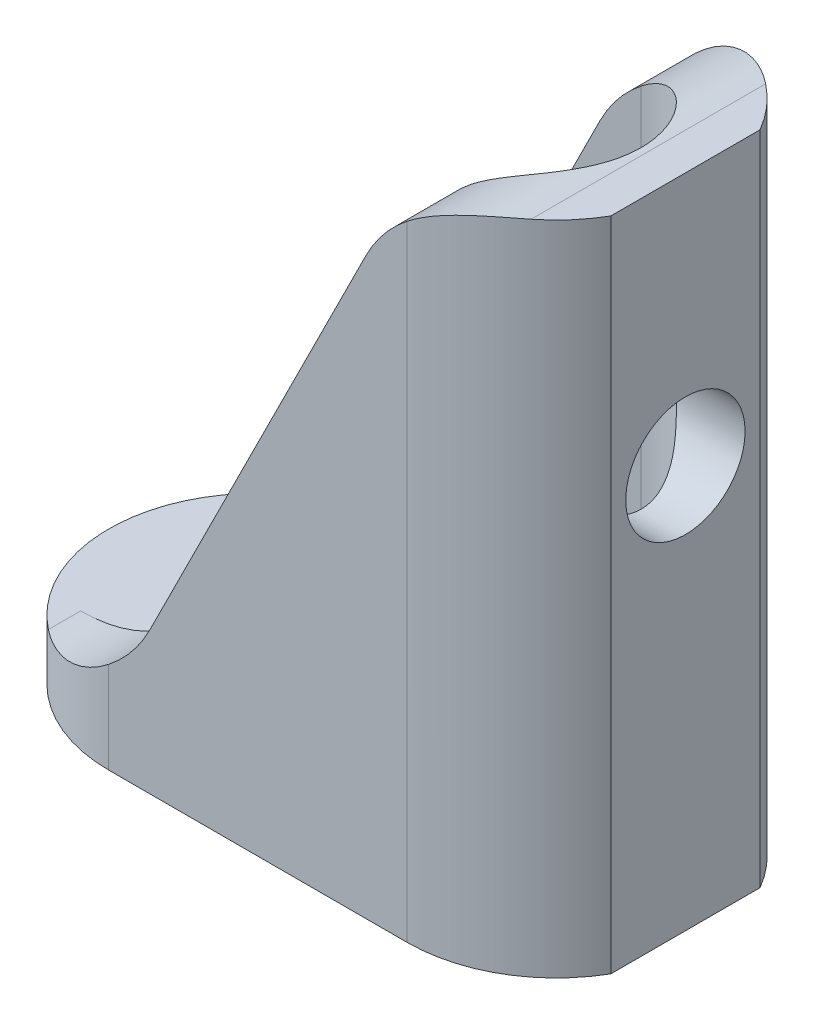
ISO-10303-21;
HEADER;
FILE_DESCRIPTION(('STEP AP214'),'2;1');
FILE_NAME('part.step','',(''),(''),'','','');
FILE_SCHEMA(('AUTOMOTIVE_DESIGN { 1 0 10303 214 1 1 1 1 }'));
ENDSEC;
DATA;
#1=APPLICATION_CONTEXT('core data for automotive mechanical design processes');
#2=APPLICATION_PROTOCOL_DEFINITION('international standard','automotive_design',2000,#1);
#3=PRODUCT_CONTEXT('',#1,'mechanical');
#4=PRODUCT('Part','Part','',(#3));
#5=PRODUCT_RELATED_PRODUCT_CATEGORY('part','',(#4));
#6=PRODUCT_DEFINITION_FORMATION('','',#4);
#7=PRODUCT_DEFINITION_CONTEXT('part definition',#1,'design');
#8=PRODUCT_DEFINITION('design','',#6,#7);
#9=PRODUCT_DEFINITION_SHAPE('','',#8);
#10=(LENGTH_UNIT() NAMED_UNIT(*) SI_UNIT(.MILLI.,.METRE.));
#11=(NAMED_UNIT(*) PLANE_ANGLE_UNIT() SI_UNIT($,.RADIAN.));
#12=(NAMED_UNIT(*) SI_UNIT($,.STERADIAN.) SOLID_ANGLE_UNIT());
#13=UNCERTAINTY_MEASURE_WITH_UNIT(LENGTH_MEASURE(1.E-05),#10,'distance_accuracy_value','');
#14=(GEOMETRIC_REPRESENTATION_CONTEXT(3) GLOBAL_UNCERTAINTY_ASSIGNED_CONTEXT((#13)) GLOBAL_UNIT_ASSIGNED_CONTEXT((#10,
#11,#12)) REPRESENTATION_CONTEXT('',''));
#15=CARTESIAN_POINT('',(0.,0.,0.));
#16=DIRECTION('',(0.,0.,1.));
#17=DIRECTION('',(1.,0.,0.));
#18=AXIS2_PLACEMENT_3D('',#15,#16,#17);
#19=CARTESIAN_POINT('',(0.,0.,0.));
#20=DIRECTION('',(0.,1.,0.));
#21=DIRECTION('',(0.,0.,1.));
#22=AXIS2_PLACEMENT_3D('',#19,#20,#21);
#23=PLANE('',#22);
#24=CARTESIAN_POINT('',(0.,0.,0.));
#25=DIRECTION('',(0.,1.,0.));
#26=DIRECTION('',(0.,0.,1.));
#27=AXIS2_PLACEMENT_3D('',#24,#25,#26);
#28=CIRCLE('',#27,2.);
#29=CARTESIAN_POINT('',(0.,0.,-2.));
#30=VERTEX_POINT('',#29);
#31=CARTESIAN_POINT('',(0.,0.,2.));
#32=VERTEX_POINT('',#31);
#33=EDGE_CURVE('E205',#30,#32,#28,.T.);
#34=ORIENTED_EDGE('',*,*,#33,.T.);
#35=DIRECTION('',(1.,0.,0.));
#36=VECTOR('',#35,1.);
#37=CARTESIAN_POINT('',(0.,0.,2.));
#38=LINE('',#37,#36);
#39=CARTESIAN_POINT('',(10.,0.,2.));
#40=VERTEX_POINT('',#39);
#41=EDGE_CURVE('E219',#32,#40,#38,.T.);
#42=ORIENTED_EDGE('',*,*,#41,.T.);
#43=CARTESIAN_POINT('',(10.,0.,0.));
#44=DIRECTION('',(0.,1.,0.));
#45=DIRECTION('',(0.,0.,1.));
#46=AXIS2_PLACEMENT_3D('',#43,#44,#45);
#47=CIRCLE('',#46,2.);
#48=CARTESIAN_POINT('',(10.,0.,-2.));
#49=VERTEX_POINT('',#48);
#50=EDGE_CURVE('E222',#40,#49,#47,.T.);
#51=ORIENTED_EDGE('',*,*,#50,.T.);
#52=DIRECTION('',(-1.,0.,0.));
#53=VECTOR('',#52,1.);
#54=CARTESIAN_POINT('',(0.,0.,-2.));
#55=LINE('',#54,#53);
#56=EDGE_CURVE('E209',#49,#30,#55,.T.);
#57=ORIENTED_EDGE('',*,*,#56,.T.);
#58=EDGE_LOOP('',(#34,#42,#51,#57));
#59=FACE_BOUND('',#58,.T.);
#60=DIRECTION('',(0.,0.,1.));
#61=VECTOR('',#60,1.);
#62=CARTESIAN_POINT('',(14.3301270189222,0.,0.));
#63=LINE('',#62,#61);
#64=CARTESIAN_POINT('',(14.3301270189222,0.,-2.5));
#65=VERTEX_POINT('',#64);
#66=CARTESIAN_POINT('',(14.3301270189222,0.,2.5));
#67=VERTEX_POINT('',#66);
#68=EDGE_CURVE('E171',#65,#67,#63,.T.);
#69=ORIENTED_EDGE('',*,*,#68,.T.);
#70=CARTESIAN_POINT('',(10.,0.,0.));
#71=DIRECTION('',(0.,1.,0.));
#72=DIRECTION('',(0.,0.,1.));
#73=AXIS2_PLACEMENT_3D('',#70,#71,#72);
#74=CIRCLE('',#73,5.);
#75=CARTESIAN_POINT('',(10.,0.,5.));
#76=VERTEX_POINT('',#75);
#77=EDGE_CURVE('E180',#76,#67,#74,.T.);
#78=ORIENTED_EDGE('',*,*,#77,.F.);
#79=DIRECTION('',(1.,0.,0.));
#80=VECTOR('',#79,1.);
#81=CARTESIAN_POINT('',(0.,0.,5.));
#82=LINE('',#81,#80);
#83=CARTESIAN_POINT('',(0.,0.,5.));
#84=VERTEX_POINT('',#83);
#85=EDGE_CURVE('E243',#84,#76,#82,.T.);
#86=ORIENTED_EDGE('',*,*,#85,.F.);
#87=CARTESIAN_POINT('',(0.,0.,0.));
#88=DIRECTION('',(0.,1.,0.));
#89=DIRECTION('',(0.,0.,1.));
#90=AXIS2_PLACEMENT_3D('',#87,#88,#89);
#91=CIRCLE('',#90,5.);
#92=CARTESIAN_POINT('',(0.,0.,-5.));
#93=VERTEX_POINT('',#92);
#94=EDGE_CURVE('E236',#93,#84,#91,.T.);
#95=ORIENTED_EDGE('',*,*,#94,.F.);
#96=DIRECTION('',(-1.,0.,0.));
#97=VECTOR('',#96,1.);
#98=CARTESIAN_POINT('',(0.,0.,-5.));
#99=LINE('',#98,#97);
#100=CARTESIAN_POINT('',(10.,0.,-5.));
#101=VERTEX_POINT('',#100);
#102=EDGE_CURVE('E241',#101,#93,#99,.T.);
#103=ORIENTED_EDGE('',*,*,#102,.F.);
#104=EDGE_CURVE('E246',#65,#101,#74,.T.);
#105=ORIENTED_EDGE('',*,*,#104,.F.);
#106=EDGE_LOOP('',(#69,#78,#86,#95,#103,#105));
#107=FACE_BOUND('',#106,.T.);
#108=ADVANCED_FACE('F34',(#59,#107),#23,.F.);
#109=CARTESIAN_POINT('',(10.,2.,0.));
#110=DIRECTION('',(0.,-1.,0.));
#111=DIRECTION('',(0.,0.,-1.));
#112=AXIS2_PLACEMENT_3D('',#109,#110,#111);
#113=CYLINDRICAL_SURFACE('',#112,5.);
#114=DIRECTION('',(0.,-1.,0.));
#115=VECTOR('',#114,1.);
#116=CARTESIAN_POINT('',(14.3301270189222,22.,2.5));
#117=LINE('',#116,#115);
#118=CARTESIAN_POINT('',(14.3301270189222,22.,2.5));
#119=VERTEX_POINT('',#118);
#120=EDGE_CURVE('E166',#119,#67,#117,.T.);
#121=ORIENTED_EDGE('',*,*,#120,.F.);
#122=CARTESIAN_POINT('',(10.,22.,0.));
#123=DIRECTION('',(0.,1.,0.));
#124=DIRECTION('',(0.,0.,1.));
#125=AXIS2_PLACEMENT_3D('',#122,#123,#124);
#126=CIRCLE('',#125,5.);
#127=CARTESIAN_POINT('',(13.0901699437495,22.,3.93075688878712));
#128=VERTEX_POINT('',#127);
#129=EDGE_CURVE('E177',#128,#119,#126,.T.);
#130=ORIENTED_EDGE('',*,*,#129,.F.);
#131=CARTESIAN_POINT('',(13.0901699437495,22.,3.93075688878712));
#132=CARTESIAN_POINT('',(13.0049567409293,22.0000106443207,3.99777049014228));
#133=CARTESIAN_POINT('',(12.9175208470636,21.9978217442673,4.06200131989047));
#134=CARTESIAN_POINT('',(12.7388048481984,21.9884392743008,4.18457248866539));
#135=CARTESIAN_POINT('',(12.6475226677203,21.9812429690137,4.24290958819303));
#136=CARTESIAN_POINT('',(12.4620063268731,21.9612599378402,4.35317751358719));
#137=CARTESIAN_POINT('',(12.3677788210296,21.9484850725356,4.40512163286476));
#138=CARTESIAN_POINT('',(12.1770081701362,21.9168566209036,4.50245442391839));
#139=CARTESIAN_POINT('',(12.0804655506896,21.8980044024555,4.54784456752568));
#140=CARTESIAN_POINT('',(11.8854971729066,21.8537407726496,4.63208679928392));
#141=CARTESIAN_POINT('',(11.7870649051567,21.828300287882,4.67090861356537));
#142=CARTESIAN_POINT('',(11.5897188625495,21.7706617958058,4.74170693083525));
#143=CARTESIAN_POINT('',(11.4908050907298,21.7384638310726,4.77368347694948));
#144=CARTESIAN_POINT('',(11.2935256677494,21.6672324217771,4.83087284963891));
#145=CARTESIAN_POINT('',(11.1951598274356,21.6282015091605,4.85608817285053));
#146=CARTESIAN_POINT('',(10.9999505607425,21.5433820963228,4.90001198960971));
#147=CARTESIAN_POINT('',(10.9031068367935,21.4975949355799,4.91872177046883));
#148=CARTESIAN_POINT('',(10.6660059218015,21.375915635311,4.95751275578921));
#149=CARTESIAN_POINT('',(10.5271283574913,21.2960960678455,4.97397326413417));
#150=CARTESIAN_POINT('',(10.3247243511915,21.1663848841562,4.9899055437224));
#151=CARTESIAN_POINT('',(10.2582391095803,21.1214821189729,4.99375653453521));
#152=CARTESIAN_POINT('',(10.1274419436835,21.0284828500238,4.99880320397726));
#153=CARTESIAN_POINT('',(10.0631298713663,20.9803865644579,4.99999906382872));
#154=CARTESIAN_POINT('',(10.,20.9307568887871,5.));
#155=B_SPLINE_CURVE_WITH_KNOTS('',3,(#131,#132,#133,#134,#135,#136,#137,#138,#139,#140,#141,
#142,#143,#144,#145,#146,#147,#148,#149,#150,#151,#152,#153,#154),.UNSPECIFIED.,.F.,.F.,(4,2,2,
2,2,2,2,2,2,2,2,4),(0.,0.325182185280488,0.650542146048252,0.975213701247999,1.29981223093417,
1.62586834497974,1.95192240478201,2.27785590015483,2.60372486331215,3.08538584626341,
3.32623627685176,3.56707026802709),.UNSPECIFIED.);
#156=CARTESIAN_POINT('',(10.,20.9307568887871,5.));
#157=VERTEX_POINT('',#156);
#158=EDGE_CURVE('E293',#128,#157,#155,.T.);
#159=ORIENTED_EDGE('',*,*,#158,.T.);
#160=DIRECTION('',(0.,-1.,0.));
#161=VECTOR('',#160,1.);
#162=CARTESIAN_POINT('',(10.,2.,5.));
#163=LINE('',#162,#161);
#164=EDGE_CURVE('E254',#157,#76,#163,.T.);
#165=ORIENTED_EDGE('',*,*,#164,.T.);
#166=ORIENTED_EDGE('',*,*,#77,.T.);
#167=EDGE_LOOP('',(#121,#130,#159,#165,#166));
#168=FACE_BOUND('',#167,.T.);
#169=ADVANCED_FACE('F176',(#168),#113,.T.);
#170=DIRECTION('',(0.,-1.,0.));
#171=VECTOR('',#170,1.);
#172=CARTESIAN_POINT('',(14.3301270189222,22.,-2.5));
#173=LINE('',#172,#171);
#174=CARTESIAN_POINT('',(14.3301270189222,22.,-2.5));
#175=VERTEX_POINT('',#174);
#176=EDGE_CURVE('E50',#175,#65,#173,.T.);
#177=ORIENTED_EDGE('',*,*,#176,.T.);
#178=ORIENTED_EDGE('',*,*,#104,.T.);
#179=DIRECTION('',(0.,-1.,0.));
#180=VECTOR('',#179,1.);
#181=CARTESIAN_POINT('',(10.,2.,-5.));
#182=LINE('',#181,#180);
#183=CARTESIAN_POINT('',(10.,20.9307568887871,-5.));
#184=VERTEX_POINT('',#183);
#185=EDGE_CURVE('E251',#184,#101,#182,.T.);
#186=ORIENTED_EDGE('',*,*,#185,.F.);
#187=CARTESIAN_POINT('',(10.,20.9307568887871,-5.));
#188=CARTESIAN_POINT('',(10.0852132028201,20.9977704901423,-5.00001064432072));
#189=CARTESIAN_POINT('',(10.1726490966859,21.0620013198905,-4.99782174426735));
#190=CARTESIAN_POINT('',(10.3513650955511,21.1845724886654,-4.98843927430082));
#191=CARTESIAN_POINT('',(10.4426472760292,21.242909588193,-4.98124296901368));
#192=CARTESIAN_POINT('',(10.6281636168764,21.3531775135872,-4.96125993784018));
#193=CARTESIAN_POINT('',(10.7223911227199,21.4051216328648,-4.9484850725356));
#194=CARTESIAN_POINT('',(10.9131617736132,21.5024544239184,-4.91685662090355));
#195=CARTESIAN_POINT('',(11.0097043930599,21.5478445675257,-4.89800440245554));
#196=CARTESIAN_POINT('',(11.2046727708429,21.6320867992839,-4.85374077264961));
#197=CARTESIAN_POINT('',(11.3031050385928,21.6709086135654,-4.82830028788198));
#198=CARTESIAN_POINT('',(11.5004510812,21.7417069308352,-4.77066179580583));
#199=CARTESIAN_POINT('',(11.5993648530197,21.7736834769495,-4.73846383107256));
#200=CARTESIAN_POINT('',(11.796644276,21.8308728496389,-4.6672324217771));
#201=CARTESIAN_POINT('',(11.8950101163139,21.8560881728505,-4.62820150916051));
#202=CARTESIAN_POINT('',(12.090219383007,21.9000119896097,-4.54338209632282));
#203=CARTESIAN_POINT('',(12.187063106956,21.9187217704688,-4.49759493557987));
#204=CARTESIAN_POINT('',(12.424164021948,21.9575127557892,-4.37591563531105));
#205=CARTESIAN_POINT('',(12.5630415862582,21.9739732641342,-4.29609606784546));
#206=CARTESIAN_POINT('',(12.765445592558,21.9899055437224,-4.16638488415618));
#207=CARTESIAN_POINT('',(12.8319308341691,21.9937565345352,-4.12148211897293));
#208=CARTESIAN_POINT('',(12.9627280000659,21.9988032039773,-4.02848285002378));
#209=CARTESIAN_POINT('',(13.0270400723831,21.9999990638287,-3.98038656445792));
#210=CARTESIAN_POINT('',(13.0901699437495,22.,-3.93075688878712));
#211=B_SPLINE_CURVE_WITH_KNOTS('',3,(#187,#188,#189,#190,#191,#192,#193,#194,#195,#196,#197,
#198,#199,#200,#201,#202,#203,#204,#205,#206,#207,#208,#209,#210),.UNSPECIFIED.,.F.,.F.,(4,2,2,
2,2,2,2,2,2,2,2,4),(0.,0.325182185280489,0.650542146048251,0.975213701247997,1.29981223093417,
1.62586834497974,1.95192240478201,2.27785590015482,2.60372486331214,3.0853858462634,
3.32623627685175,3.56707026802709),.UNSPECIFIED.);
#212=CARTESIAN_POINT('',(13.0901699437495,22.,-3.93075688878712));
#213=VERTEX_POINT('',#212);
#214=EDGE_CURVE('E301',#184,#213,#211,.T.);
#215=ORIENTED_EDGE('',*,*,#214,.T.);
#216=EDGE_CURVE('E187',#175,#213,#126,.T.);
#217=ORIENTED_EDGE('',*,*,#216,.F.);
#218=EDGE_LOOP('',(#177,#178,#186,#215,#217));
#219=FACE_BOUND('',#218,.T.);
#220=ADVANCED_FACE('F310',(#219),#113,.T.);
#221=CARTESIAN_POINT('',(0.,22.,0.));
#222=DIRECTION('',(0.,1.,0.));
#223=DIRECTION('',(0.,0.,1.));
#224=AXIS2_PLACEMENT_3D('',#221,#222,#223);
#225=PLANE('',#224);
#226=ORIENTED_EDGE('',*,*,#129,.T.);
#227=DIRECTION('',(0.,0.,1.));
#228=VECTOR('',#227,1.);
#229=CARTESIAN_POINT('',(14.3301270189222,22.,0.));
#230=LINE('',#229,#228);
#231=EDGE_CURVE('E163',#175,#119,#230,.T.);
#232=ORIENTED_EDGE('',*,*,#231,.F.);
#233=ORIENTED_EDGE('',*,*,#216,.T.);
#234=DIRECTION('',(0.,0.,-1.));
#235=VECTOR('',#234,1.);
#236=CARTESIAN_POINT('',(13.0901699437495,22.,-2.85));
#237=LINE('',#236,#235);
#238=EDGE_CURVE('E185',#213,#128,#237,.F.);
#239=ORIENTED_EDGE('',*,*,#238,.T.);
#240=EDGE_LOOP('',(#226,#232,#233,#239));
#241=FACE_BOUND('',#240,.T.);
#242=ADVANCED_FACE('F183',(#241),#225,.T.);
#243=CARTESIAN_POINT('',(0.,2.,0.));
#244=DIRECTION('',(0.,1.,0.));
#245=DIRECTION('',(0.,0.,1.));
#246=AXIS2_PLACEMENT_3D('',#243,#244,#245);
#247=PLANE('',#246);
#248=DIRECTION('',(1.,0.,0.));
#249=VECTOR('',#248,1.);
#250=CARTESIAN_POINT('',(0.,2.,2.));
#251=LINE('',#250,#249);
#252=CARTESIAN_POINT('',(0.,2.,2.));
#253=VERTEX_POINT('',#252);
#254=CARTESIAN_POINT('',(10.,2.,2.));
#255=VERTEX_POINT('',#254);
#256=EDGE_CURVE('E208',#253,#255,#251,.T.);
#257=ORIENTED_EDGE('',*,*,#256,.F.);
#258=CARTESIAN_POINT('',(0.,2.,0.));
#259=DIRECTION('',(0.,1.,0.));
#260=DIRECTION('',(0.,0.,1.));
#261=AXIS2_PLACEMENT_3D('',#258,#259,#260);
#262=CIRCLE('',#261,2.);
#263=CARTESIAN_POINT('',(0.,2.,-2.));
#264=VERTEX_POINT('',#263);
#265=EDGE_CURVE('E206',#264,#253,#262,.T.);
#266=ORIENTED_EDGE('',*,*,#265,.F.);
#267=DIRECTION('',(-1.,0.,0.));
#268=VECTOR('',#267,1.);
#269=CARTESIAN_POINT('',(0.,2.,-2.));
#270=LINE('',#269,#268);
#271=CARTESIAN_POINT('',(10.,2.,-2.));
#272=VERTEX_POINT('',#271);
#273=EDGE_CURVE('E214',#272,#264,#270,.T.);
#274=ORIENTED_EDGE('',*,*,#273,.F.);
#275=CARTESIAN_POINT('',(10.,2.,0.));
#276=DIRECTION('',(0.,1.,0.));
#277=DIRECTION('',(0.,0.,1.));
#278=AXIS2_PLACEMENT_3D('',#275,#276,#277);
#279=CIRCLE('',#278,2.);
#280=EDGE_CURVE('E211',#255,#272,#279,.T.);
#281=ORIENTED_EDGE('',*,*,#280,.F.);
#282=EDGE_LOOP('',(#257,#266,#274,#281));
#283=FACE_BOUND('',#282,.T.);
#284=DIRECTION('',(1.,0.,0.));
#285=VECTOR('',#284,1.);
#286=CARTESIAN_POINT('',(0.,2.,-2.85));
#287=LINE('',#286,#285);
#288=CARTESIAN_POINT('',(-3.09016994374947,2.,-2.85));
#289=VERTEX_POINT('',#288);
#290=CARTESIAN_POINT('',(10.,2.,-2.85));
#291=VERTEX_POINT('',#290);
#292=EDGE_CURVE('E191',#289,#291,#287,.T.);
#293=ORIENTED_EDGE('',*,*,#292,.F.);
#294=DIRECTION('',(0.,0.,-1.));
#295=VECTOR('',#294,1.);
#296=CARTESIAN_POINT('',(-3.09016994374947,2.,0.));
#297=LINE('',#296,#295);
#298=CARTESIAN_POINT('',(-3.09016994374947,2.,-3.93075688878712));
#299=VERTEX_POINT('',#298);
#300=EDGE_CURVE('E365',#289,#299,#297,.T.);
#301=ORIENTED_EDGE('',*,*,#300,.T.);
#302=CARTESIAN_POINT('',(0.,2.,0.));
#303=DIRECTION('',(0.,1.,0.));
#304=DIRECTION('',(0.,0.,1.));
#305=AXIS2_PLACEMENT_3D('',#302,#303,#304);
#306=CIRCLE('',#305,5.);
#307=CARTESIAN_POINT('',(-3.09016994374947,2.,3.93075688878712));
#308=VERTEX_POINT('',#307);
#309=EDGE_CURVE('E237',#299,#308,#306,.T.);
#310=ORIENTED_EDGE('',*,*,#309,.T.);
#311=DIRECTION('',(0.,0.,1.));
#312=VECTOR('',#311,1.);
#313=CARTESIAN_POINT('',(-3.09016994374947,2.,0.));
#314=LINE('',#313,#312);
#315=CARTESIAN_POINT('',(-3.09016994374947,2.,2.85));
#316=VERTEX_POINT('',#315);
#317=EDGE_CURVE('E385',#308,#316,#314,.F.);
#318=ORIENTED_EDGE('',*,*,#317,.T.);
#319=DIRECTION('',(1.,0.,0.));
#320=VECTOR('',#319,1.);
#321=CARTESIAN_POINT('',(0.,2.,2.85));
#322=LINE('',#321,#320);
#323=CARTESIAN_POINT('',(10.,2.,2.85));
#324=VERTEX_POINT('',#323);
#325=EDGE_CURVE('E199',#316,#324,#322,.T.);
#326=ORIENTED_EDGE('',*,*,#325,.T.);
#327=CARTESIAN_POINT('',(10.,2.,0.));
#328=DIRECTION('',(0.,1.,0.));
#329=DIRECTION('',(0.,0.,1.));
#330=AXIS2_PLACEMENT_3D('',#327,#328,#329);
#331=CIRCLE('',#330,2.85);
#332=EDGE_CURVE('E196',#324,#291,#331,.T.);
#333=ORIENTED_EDGE('',*,*,#332,.T.);
#334=EDGE_LOOP('',(#293,#301,#310,#318,#326,#333));
#335=FACE_BOUND('',#334,.T.);
#336=ADVANCED_FACE('F323',(#283,#335),#247,.T.);
#337=CARTESIAN_POINT('',(0.,2.,0.));
#338=DIRECTION('',(0.,-1.,0.));
#339=DIRECTION('',(0.,0.,-1.));
#340=AXIS2_PLACEMENT_3D('',#337,#338,#339);
#341=CYLINDRICAL_SURFACE('',#340,5.);
#342=ORIENTED_EDGE('',*,*,#94,.T.);
#343=DIRECTION('',(0.,-1.,0.));
#344=VECTOR('',#343,1.);
#345=CARTESIAN_POINT('',(0.,2.,5.));
#346=LINE('',#345,#344);
#347=CARTESIAN_POINT('',(0.,3.06924311121288,5.));
#348=VERTEX_POINT('',#347);
#349=EDGE_CURVE('E58',#348,#84,#346,.T.);
#350=ORIENTED_EDGE('',*,*,#349,.F.);
#351=CARTESIAN_POINT('',(0.,3.06924311121288,5.));
#352=CARTESIAN_POINT('',(-0.0852132028201255,3.00222950985772,5.00001064432072));
#353=CARTESIAN_POINT('',(-0.172649096685909,2.93799868010953,4.99782174426735));
#354=CARTESIAN_POINT('',(-0.351365095551066,2.81542751133461,4.98843927430082));
#355=CARTESIAN_POINT('',(-0.44264727602915,2.75709041180697,4.98124296901368));
#356=CARTESIAN_POINT('',(-0.628163616876409,2.64682248641282,4.96125993784018));
#357=CARTESIAN_POINT('',(-0.722391122719878,2.59487836713524,4.9484850725356));
#358=CARTESIAN_POINT('',(-0.913161773613238,2.49754557608161,4.91685662090355));
#359=CARTESIAN_POINT('',(-1.00970439305987,2.45215543247432,4.89800440245554));
#360=CARTESIAN_POINT('',(-1.20467277084289,2.36791320071608,4.85374077264961));
#361=CARTESIAN_POINT('',(-1.30310503859279,2.32909138643463,4.82830028788199));
#362=CARTESIAN_POINT('',(-1.50045108119997,2.25829306916475,4.77066179580583));
#363=CARTESIAN_POINT('',(-1.59936485301972,2.22631652305052,4.73846383107256));
#364=CARTESIAN_POINT('',(-1.79664427600004,2.16912715036109,4.6672324217771));
#365=CARTESIAN_POINT('',(-1.89501011631387,2.14391182714947,4.6282015091605));
#366=CARTESIAN_POINT('',(-2.090219383007,2.09998801039029,4.54338209632282));
#367=CARTESIAN_POINT('',(-2.187063106956,2.08127822953117,4.49759493557986));
#368=CARTESIAN_POINT('',(-2.42416402194802,2.04248724421079,4.37591563531105));
#369=CARTESIAN_POINT('',(-2.56304158625822,2.02602673586583,4.29609606784546));
#370=CARTESIAN_POINT('',(-2.76544559255797,2.0100944562776,4.16638488415618));
#371=CARTESIAN_POINT('',(-2.83193083416913,2.00624346546479,4.12148211897293));
#372=CARTESIAN_POINT('',(-2.96272800006594,2.00119679602274,4.02848285002378));
#373=CARTESIAN_POINT('',(-3.02704007238313,2.00000093617128,3.98038656445792));
#374=CARTESIAN_POINT('',(-3.09016994374947,2.,3.93075688878712));
#375=B_SPLINE_CURVE_WITH_KNOTS('',3,(#351,#352,#353,#354,#355,#356,#357,#358,#359,#360,#361,
#362,#363,#364,#365,#366,#367,#368,#369,#370,#371,#372,#373,#374),.UNSPECIFIED.,.F.,.F.,(4,2,2,
2,2,2,2,2,2,2,2,4),(0.,0.325182185280487,0.650542146048251,0.975213701247998,1.29981223093417,
1.62586834497974,1.95192240478201,2.27785590015483,2.60372486331215,3.08538584626341,
3.32623627685176,3.56707026802709),.UNSPECIFIED.);
#376=EDGE_CURVE('E43',#348,#308,#375,.T.);
#377=ORIENTED_EDGE('',*,*,#376,.T.);
#378=ORIENTED_EDGE('',*,*,#309,.F.);
#379=CARTESIAN_POINT('',(-3.09016994374947,2.,-3.93075688878712));
#380=CARTESIAN_POINT('',(-3.00495674092935,1.99998935567928,-3.99777049014228));
#381=CARTESIAN_POINT('',(-2.91752084706357,2.00217825573265,-4.06200131989047));
#382=CARTESIAN_POINT('',(-2.73880484819841,2.01156072569919,-4.18457248866539));
#383=CARTESIAN_POINT('',(-2.64752266772032,2.01875703098632,-4.24290958819303));
#384=CARTESIAN_POINT('',(-2.46200632687307,2.03874006215982,-4.35317751358718));
#385=CARTESIAN_POINT('',(-2.3677788210296,2.0515149274644,-4.40512163286476));
#386=CARTESIAN_POINT('',(-2.17700817013624,2.08314337909645,-4.50245442391839));
#387=CARTESIAN_POINT('',(-2.08046555068961,2.10199559754446,-4.54784456752568));
#388=CARTESIAN_POINT('',(-1.88549717290658,2.14625922735039,-4.63208679928392));
#389=CARTESIAN_POINT('',(-1.78706490515669,2.17169971211802,-4.67090861356537));
#390=CARTESIAN_POINT('',(-1.58971886254951,2.22933820419417,-4.74170693083525));
#391=CARTESIAN_POINT('',(-1.49080509072976,2.26153616892744,-4.77368347694949));
#392=CARTESIAN_POINT('',(-1.29352566774944,2.3327675782229,-4.83087284963891));
#393=CARTESIAN_POINT('',(-1.1951598274356,2.3717984908395,-4.85608817285053));
#394=CARTESIAN_POINT('',(-0.999950560742477,2.45661790367718,-4.90001198960971));
#395=CARTESIAN_POINT('',(-0.903106836793472,2.50240506442014,-4.91872177046883));
#396=CARTESIAN_POINT('',(-0.666005921801453,2.62408436468896,-4.95751275578921));
#397=CARTESIAN_POINT('',(-0.527128357491252,2.70390393215454,-4.97397326413417));
#398=CARTESIAN_POINT('',(-0.324724351191499,2.83361511584382,-4.9899055437224));
#399=CARTESIAN_POINT('',(-0.258239109580346,2.87851788102707,-4.99375653453521));
#400=CARTESIAN_POINT('',(-0.127441943683538,2.97151714997622,-4.99880320397726));
#401=CARTESIAN_POINT('',(-0.0631298713663469,3.01961343554208,-4.99999906382872));
#402=CARTESIAN_POINT('',(0.,3.06924311121288,-5.));
#403=B_SPLINE_CURVE_WITH_KNOTS('',3,(#379,#380,#381,#382,#383,#384,#385,#386,#387,#388,#389,
#390,#391,#392,#393,#394,#395,#396,#397,#398,#399,#400,#401,#402),.UNSPECIFIED.,.F.,.F.,(4,2,2,
2,2,2,2,2,2,2,2,4),(0.,0.325182185280487,0.650542146048251,0.975213701247998,1.29981223093417,
1.62586834497974,1.95192240478201,2.27785590015483,2.60372486331215,3.08538584626341,
3.32623627685176,3.56707026802709),.UNSPECIFIED.);
#404=CARTESIAN_POINT('',(0.,3.06924311121288,-5.));
#405=VERTEX_POINT('',#404);
#406=EDGE_CURVE('E383',#299,#405,#403,.T.);
#407=ORIENTED_EDGE('',*,*,#406,.T.);
#408=DIRECTION('',(0.,-1.,0.));
#409=VECTOR('',#408,1.);
#410=CARTESIAN_POINT('',(0.,2.,-5.));
#411=LINE('',#410,#409);
#412=EDGE_CURVE('E240',#405,#93,#411,.T.);
#413=ORIENTED_EDGE('',*,*,#412,.T.);
#414=EDGE_LOOP('',(#342,#350,#377,#378,#407,#413));
#415=FACE_BOUND('',#414,.T.);
#416=ADVANCED_FACE('F286',(#415),#341,.T.);
#417=CARTESIAN_POINT('',(0.,2.,5.));
#418=DIRECTION('',(0.,0.,-1.));
#419=DIRECTION('',(-1.,0.,0.));
#420=AXIS2_PLACEMENT_3D('',#417,#418,#419);
#421=PLANE('',#420);
#422=ORIENTED_EDGE('',*,*,#164,.F.);
#423=CARTESIAN_POINT('',(13.0901699437495,17.,5.));
#424=DIRECTION('',(0.,0.,-1.));
#425=DIRECTION('',(-1.,0.,0.));
#426=AXIS2_PLACEMENT_3D('',#423,#424,#425);
#427=CIRCLE('',#426,5.);
#428=CARTESIAN_POINT('',(8.6180339887499,19.2360679774998,5.));
#429=VERTEX_POINT('',#428);
#430=EDGE_CURVE('E300',#157,#429,#427,.F.);
#431=ORIENTED_EDGE('',*,*,#430,.T.);
#432=DIRECTION('',(-0.447213595499958,-0.894427190999916,0.));
#433=VECTOR('',#432,1.);
#434=CARTESIAN_POINT('',(0.,2.,5.));
#435=LINE('',#434,#433);
#436=CARTESIAN_POINT('',(1.38196601125011,4.76393202250021,5.));
#437=VERTEX_POINT('',#436);
#438=EDGE_CURVE('E418',#429,#437,#435,.T.);
#439=ORIENTED_EDGE('',*,*,#438,.T.);
#440=CARTESIAN_POINT('',(-3.09016994374947,7.,5.));
#441=DIRECTION('',(0.,0.,-1.));
#442=DIRECTION('',(-1.,0.,0.));
#443=AXIS2_PLACEMENT_3D('',#440,#441,#442);
#444=CIRCLE('',#443,5.);
#445=EDGE_CURVE('E378',#437,#348,#444,.T.);
#446=ORIENTED_EDGE('',*,*,#445,.T.);
#447=ORIENTED_EDGE('',*,*,#349,.T.);
#448=ORIENTED_EDGE('',*,*,#85,.T.);
#449=EDGE_LOOP('',(#422,#431,#439,#446,#447,#448));
#450=FACE_BOUND('',#449,.T.);
#451=ADVANCED_FACE('F313',(#450),#421,.F.);
#452=CARTESIAN_POINT('',(0.,2.,-5.));
#453=DIRECTION('',(0.,0.,1.));
#454=DIRECTION('',(1.,0.,0.));
#455=AXIS2_PLACEMENT_3D('',#452,#453,#454);
#456=PLANE('',#455);
#457=DIRECTION('',(-0.447213595499958,-0.894427190999916,0.));
#458=VECTOR('',#457,1.);
#459=CARTESIAN_POINT('',(0.,2.,-5.));
#460=LINE('',#459,#458);
#461=CARTESIAN_POINT('',(8.6180339887499,19.2360679774998,-5.));
#462=VERTEX_POINT('',#461);
#463=CARTESIAN_POINT('',(1.38196601125011,4.76393202250021,-5.));
#464=VERTEX_POINT('',#463);
#465=EDGE_CURVE('E181',#462,#464,#460,.T.);
#466=ORIENTED_EDGE('',*,*,#465,.F.);
#467=CARTESIAN_POINT('',(13.0901699437495,17.,-5.));
#468=DIRECTION('',(0.,0.,1.));
#469=DIRECTION('',(1.,0.,0.));
#470=AXIS2_PLACEMENT_3D('',#467,#468,#469);
#471=CIRCLE('',#470,5.);
#472=EDGE_CURVE('E392',#462,#184,#471,.F.);
#473=ORIENTED_EDGE('',*,*,#472,.T.);
#474=ORIENTED_EDGE('',*,*,#185,.T.);
#475=ORIENTED_EDGE('',*,*,#102,.T.);
#476=ORIENTED_EDGE('',*,*,#412,.F.);
#477=CARTESIAN_POINT('',(-3.09016994374947,7.,-5.));
#478=DIRECTION('',(0.,0.,1.));
#479=DIRECTION('',(1.,0.,0.));
#480=AXIS2_PLACEMENT_3D('',#477,#478,#479);
#481=CIRCLE('',#480,5.);
#482=EDGE_CURVE('E379',#405,#464,#481,.T.);
#483=ORIENTED_EDGE('',*,*,#482,.T.);
#484=EDGE_LOOP('',(#466,#473,#474,#475,#476,#483));
#485=FACE_BOUND('',#484,.T.);
#486=ADVANCED_FACE('F311',(#485),#456,.F.);
#487=CARTESIAN_POINT('',(0.,2.,0.));
#488=DIRECTION('',(0.,-1.,0.));
#489=DIRECTION('',(0.,0.,-1.));
#490=AXIS2_PLACEMENT_3D('',#487,#488,#489);
#491=CYLINDRICAL_SURFACE('',#490,2.);
#492=ORIENTED_EDGE('',*,*,#33,.F.);
#493=DIRECTION('',(0.,-1.,0.));
#494=VECTOR('',#493,1.);
#495=CARTESIAN_POINT('',(0.,2.,-2.));
#496=LINE('',#495,#494);
#497=EDGE_CURVE('E216',#264,#30,#496,.T.);
#498=ORIENTED_EDGE('',*,*,#497,.F.);
#499=ORIENTED_EDGE('',*,*,#265,.T.);
#500=DIRECTION('',(0.,-1.,0.));
#501=VECTOR('',#500,1.);
#502=CARTESIAN_POINT('',(0.,2.,2.));
#503=LINE('',#502,#501);
#504=EDGE_CURVE('E233',#253,#32,#503,.T.);
#505=ORIENTED_EDGE('',*,*,#504,.T.);
#506=EDGE_LOOP('',(#492,#498,#499,#505));
#507=FACE_BOUND('',#506,.T.);
#508=ADVANCED_FACE('F321',(#507),#491,.F.);
#509=CARTESIAN_POINT('',(0.,2.,2.));
#510=DIRECTION('',(0.,0.,-1.));
#511=DIRECTION('',(-1.,0.,0.));
#512=AXIS2_PLACEMENT_3D('',#509,#510,#511);
#513=PLANE('',#512);
#514=ORIENTED_EDGE('',*,*,#41,.F.);
#515=ORIENTED_EDGE('',*,*,#504,.F.);
#516=ORIENTED_EDGE('',*,*,#256,.T.);
#517=DIRECTION('',(0.,-1.,0.));
#518=VECTOR('',#517,1.);
#519=CARTESIAN_POINT('',(10.,2.,2.));
#520=LINE('',#519,#518);
#521=EDGE_CURVE('E231',#255,#40,#520,.T.);
#522=ORIENTED_EDGE('',*,*,#521,.T.);
#523=EDGE_LOOP('',(#514,#515,#516,#522));
#524=FACE_BOUND('',#523,.T.);
#525=ADVANCED_FACE('F336',(#524),#513,.T.);
#526=CARTESIAN_POINT('',(10.,2.,0.));
#527=DIRECTION('',(0.,-1.,0.));
#528=DIRECTION('',(0.,0.,-1.));
#529=AXIS2_PLACEMENT_3D('',#526,#527,#528);
#530=CYLINDRICAL_SURFACE('',#529,2.);
#531=ORIENTED_EDGE('',*,*,#50,.F.);
#532=ORIENTED_EDGE('',*,*,#521,.F.);
#533=ORIENTED_EDGE('',*,*,#280,.T.);
#534=DIRECTION('',(0.,-1.,0.));
#535=VECTOR('',#534,1.);
#536=CARTESIAN_POINT('',(10.,2.,-2.));
#537=LINE('',#536,#535);
#538=EDGE_CURVE('E229',#272,#49,#537,.T.);
#539=ORIENTED_EDGE('',*,*,#538,.T.);
#540=EDGE_LOOP('',(#531,#532,#533,#539));
#541=FACE_BOUND('',#540,.T.);
#542=ADVANCED_FACE('F340',(#541),#530,.F.);
#543=CARTESIAN_POINT('',(0.,2.,-2.));
#544=DIRECTION('',(0.,0.,1.));
#545=DIRECTION('',(1.,0.,0.));
#546=AXIS2_PLACEMENT_3D('',#543,#544,#545);
#547=PLANE('',#546);
#548=ORIENTED_EDGE('',*,*,#56,.F.);
#549=ORIENTED_EDGE('',*,*,#538,.F.);
#550=ORIENTED_EDGE('',*,*,#273,.T.);
#551=ORIENTED_EDGE('',*,*,#497,.T.);
#552=EDGE_LOOP('',(#548,#549,#550,#551));
#553=FACE_BOUND('',#552,.T.);
#554=ADVANCED_FACE('F343',(#553),#547,.T.);
#555=CARTESIAN_POINT('',(10.,22.,0.));
#556=DIRECTION('',(0.,-1.,0.));
#557=DIRECTION('',(0.,0.,-1.));
#558=AXIS2_PLACEMENT_3D('',#555,#556,#557);
#559=CYLINDRICAL_SURFACE('',#558,2.85);
#560=CARTESIAN_POINT('',(12.0303940504247,13.5,-2.));
#561=CARTESIAN_POINT('',(12.0304005026773,13.4040854186374,-1.99999678481893));
#562=CARTESIAN_POINT('',(12.0373252175949,13.3081534351101,-1.99303575015581));
#563=CARTESIAN_POINT('',(12.0635498663425,13.1198528800724,-1.96585593997193));
#564=CARTESIAN_POINT('',(12.082877570383,13.0274927992815,-1.94560741153611));
#565=CARTESIAN_POINT('',(12.1302604205713,12.8497730751561,-1.89359416842103));
#566=CARTESIAN_POINT('',(12.1582163672263,12.7643471371893,-1.86195970442087));
#567=CARTESIAN_POINT('',(12.2195295721709,12.6002142333267,-1.78842938306635));
#568=CARTESIAN_POINT('',(12.2528871478569,12.5215076626723,-1.74653292264902));
#569=CARTESIAN_POINT('',(12.3282617808104,12.3578634882354,-1.64510048969397));
#570=CARTESIAN_POINT('',(12.370768955432,12.2742718778706,-1.58375712526931));
#571=CARTESIAN_POINT('',(12.4555713096394,12.1173645872153,-1.44880609462526));
#572=CARTESIAN_POINT('',(12.497866157953,12.0440618778668,-1.37518319917078));
#573=CARTESIAN_POINT('',(12.5857914015968,11.8975632383922,-1.20292623775343));
#574=CARTESIAN_POINT('',(12.630791086537,11.8264481196948,-1.1021682988531));
#575=CARTESIAN_POINT('',(12.7110866450783,11.7028663967412,-0.886384590901644));
#576=CARTESIAN_POINT('',(12.746402012289,11.6503622670241,-0.771388170410256));
#577=CARTESIAN_POINT('',(12.7952844930642,11.578647823959,-0.563081012705292));
#578=CARTESIAN_POINT('',(12.8121497826988,11.5542745535011,-0.472308042773666));
#579=CARTESIAN_POINT('',(12.8370387403542,11.5184705577612,-0.287079258130936));
#580=CARTESIAN_POINT('',(12.8450694888899,11.5070294676754,-0.19262645561289));
#581=CARTESIAN_POINT('',(12.8515885270656,11.4977343002552,-0.00253370776834094));
#582=CARTESIAN_POINT('',(12.8500580784333,11.4999069034008,0.0931082018666805));
#583=CARTESIAN_POINT('',(12.8375530823252,11.5177670533037,0.282497026466609));
#584=CARTESIAN_POINT('',(12.8265759145782,11.5334583497921,0.376243408277338));
#585=CARTESIAN_POINT('',(12.7964899456494,11.5769568520951,0.557102411249532));
#586=CARTESIAN_POINT('',(12.7775757232938,11.6044744984856,0.644318481987429));
#587=CARTESIAN_POINT('',(12.7330583036404,11.6703292142859,0.812703352159772));
#588=CARTESIAN_POINT('',(12.7074537873072,11.7086684173564,0.893870955038963));
#589=CARTESIAN_POINT('',(12.6480378749547,11.7997265981336,1.05774237836571));
#590=CARTESIAN_POINT('',(12.6136280799285,11.8535761486558,1.13959731002804));
#591=CARTESIAN_POINT('',(12.5409319408261,11.9716027527159,1.29361271424025));
#592=CARTESIAN_POINT('',(12.502641466656,12.0357908529874,1.36576266398562));
#593=CARTESIAN_POINT('',(12.417695478133,12.1857515238303,1.51181855046805));
#594=CARTESIAN_POINT('',(12.370771287619,12.2733305873682,1.58371894916322));
#595=CARTESIAN_POINT('',(12.2796277801189,12.4603482778071,1.71230722122904));
#596=CARTESIAN_POINT('',(12.2354078330309,12.5597841259686,1.76899864887083));
#597=CARTESIAN_POINT('',(12.1647704810353,12.7454926706629,1.85434675015252));
#598=CARTESIAN_POINT('',(12.1366002018464,12.8295014025669,1.88645426502633));
#599=CARTESIAN_POINT('',(12.0886267062559,13.0032186196462,1.93943877371374));
#600=CARTESIAN_POINT('',(12.0688078580035,13.0929160913909,1.9603367692252));
#601=CARTESIAN_POINT('',(12.0405483007709,13.2771570163861,1.98975089173262));
#602=CARTESIAN_POINT('',(12.0322268980786,13.3717408694982,1.99813725877043));
#603=CARTESIAN_POINT('',(12.0291123941272,13.5613497881872,2.00130309564654));
#604=CARTESIAN_POINT('',(12.0343138433735,13.6563746606347,1.99608804663679));
#605=CARTESIAN_POINT('',(12.0554696304001,13.8299186114472,1.97426278987504));
#606=CARTESIAN_POINT('',(12.0698011024639,13.9088730328122,1.9593664526978));
#607=CARTESIAN_POINT('',(12.1056485526127,14.0629190324594,1.92079078613214));
#608=CARTESIAN_POINT('',(12.1271721992979,14.1380063884647,1.89710207894901));
#609=CARTESIAN_POINT('',(12.1865832823253,14.3178648945908,1.82872647893418));
#610=CARTESIAN_POINT('',(12.2273979808802,14.4199047737289,1.77940636533813));
#611=CARTESIAN_POINT('',(12.3137925375876,14.6129285683708,1.66553031488652));
#612=CARTESIAN_POINT('',(12.3593816426587,14.7038902629427,1.60094449621851));
#613=CARTESIAN_POINT('',(12.4514034866744,14.8755776650655,1.45623548012232));
#614=CARTESIAN_POINT('',(12.4978355099849,14.9560716916016,1.37583623724006));
#615=CARTESIAN_POINT('',(12.5863388411694,15.1031486092686,1.2012107622539));
#616=CARTESIAN_POINT('',(12.6284164520628,15.1697517535006,1.10700500659588));
#617=CARTESIAN_POINT('',(12.6982350503087,15.2774602541972,0.922052891134229));
#618=CARTESIAN_POINT('',(12.7271923510216,15.3209385123627,0.833153914780724));
#619=CARTESIAN_POINT('',(12.7770286419175,15.3947644810547,0.647910326488036));
#620=CARTESIAN_POINT('',(12.7979124991839,15.425120103884,0.551570242593074));
#621=CARTESIAN_POINT('',(12.829819125127,15.471206790217,0.35321534911658));
#622=CARTESIAN_POINT('',(12.8407841170737,15.4868521881685,0.251170921200909));
#623=CARTESIAN_POINT('',(12.8514999790662,15.5021449575222,0.0453114275840219));
#624=CARTESIAN_POINT('',(12.8512554036269,15.5017988263787,-0.0585029018571013));
#625=CARTESIAN_POINT('',(12.8401768140475,15.4859827864057,-0.254061019482752));
#626=CARTESIAN_POINT('',(12.8303824543669,15.4719976758962,-0.345991045189563));
#627=CARTESIAN_POINT('',(12.8025499450468,15.4318372868181,-0.525830373099176));
#628=CARTESIAN_POINT('',(12.7845102449265,15.4056597155215,-0.613738915667348));
#629=CARTESIAN_POINT('',(12.74082129023,15.3412442324518,-0.786518415717143));
#630=CARTESIAN_POINT('',(12.7149365512492,15.3026303737714,-0.871187828063308));
#631=CARTESIAN_POINT('',(12.6576214460867,15.2150932415194,-1.03291841122256));
#632=CARTESIAN_POINT('',(12.626190021097,15.1661679992588,-1.10997812503092));
#633=CARTESIAN_POINT('',(12.554487707491,15.0508908790071,-1.26714890471058));
#634=CARTESIAN_POINT('',(12.5136029350025,14.9830107420382,-1.34585725814338));
#635=CARTESIAN_POINT('',(12.4299859279346,14.8363989212502,-1.49155868289059));
#636=CARTESIAN_POINT('',(12.3872500204518,14.7576449153642,-1.55852699515759));
#637=CARTESIAN_POINT('',(12.2967217821687,14.5768229260921,-1.68963223533116));
#638=CARTESIAN_POINT('',(12.2492080511031,14.4730394435714,-1.75161983073383));
#639=CARTESIAN_POINT('',(12.1631843324182,14.2529985417577,-1.85681381424167));
#640=CARTESIAN_POINT('',(12.1246484600529,14.1367784296651,-1.90007451269568));
#641=CARTESIAN_POINT('',(12.0744924381071,13.9329008244714,-1.95445508352408));
#642=CARTESIAN_POINT('',(12.058206936882,13.8479720091678,-1.97142696519274));
#643=CARTESIAN_POINT('',(12.0361647730377,13.6753632860467,-1.99419029552854));
#644=CARTESIAN_POINT('',(12.0303881515193,13.5876889156854,-2.0000029394461));
#645=CARTESIAN_POINT('',(12.0303940504247,13.5,-2.));
#646=B_SPLINE_CURVE_WITH_KNOTS('',3,(#560,#561,#562,#563,#564,#565,#566,#567,#568,#569,#570,
#571,#572,#573,#574,#575,#576,#577,#578,#579,#580,#581,#582,#583,#584,#585,#586,#587,#588,#589,
#590,#591,#592,#593,#594,#595,#596,#597,#598,#599,#600,#601,#602,#603,#604,#605,#606,#607,#608,
#609,#610,#611,#612,#613,#614,#615,#616,#617,#618,#619,#620,#621,#622,#623,#624,#625,#626,#627,
#628,#629,#630,#631,#632,#633,#634,#635,#636,#637,#638,#639,#640,#641,#642,#643,#644,#645),
.UNSPECIFIED.,.T.,.F.,(4,2,2,2,2,2,2,2,2,2,2,2,2,2,2,2,2,2,2,2,2,2,2,2,2,2,2,2,2,2,2,2,2,2,2,2,
2,2,2,2,2,2,4),(0.,0.287326941729454,0.575299461861355,0.860077263371648,1.1448718043312,
1.47985168063962,1.81525013538912,2.20691380452051,2.59778320629566,2.88302447513359,
3.16803696810545,3.45360821065098,3.73925868868107,4.0182815275326,4.29735941912905,
4.60774058551011,4.91845562130229,5.28489312947328,5.65124492802987,5.93298448133274,
6.21419431865182,6.49830082896681,6.78229286661879,7.02616537877495,7.27029875225042,
7.62974456855866,7.98989989462785,8.35701261396584,8.72358627704245,9.03165645104515,
9.33954061394258,9.64920684451747,9.9587472569513,10.2379660782494,10.5172374263848,
10.8058996907314,11.0946171175951,11.4284211742162,11.762920949576,12.1506909283169,
12.5373286659922,12.8005147336027,13.0632004234064),.UNSPECIFIED.);
#647=CARTESIAN_POINT('',(12.0303940504247,13.5,-2.));
#648=VERTEX_POINT('',#647);
#649=EDGE_CURVE('E424',#648,#648,#646,.T.);
#650=ORIENTED_EDGE('',*,*,#649,.F.);
#651=EDGE_LOOP('',(#650));
#652=FACE_BOUND('',#651,.T.);
#653=DIRECTION('',(0.,-1.,0.));
#654=VECTOR('',#653,1.);
#655=CARTESIAN_POINT('',(10.,22.,2.85));
#656=LINE('',#655,#654);
#657=CARTESIAN_POINT('',(10.,20.9307568887871,2.85));
#658=VERTEX_POINT('',#657);
#659=EDGE_CURVE('E189',#658,#324,#656,.T.);
#660=ORIENTED_EDGE('',*,*,#659,.F.);
#661=CARTESIAN_POINT('',(10.,20.9307568887871,2.85));
#662=CARTESIAN_POINT('',(10.0641849611611,20.9812329329048,2.85000589112443));
#663=CARTESIAN_POINT('',(10.1296451654496,21.0301337577346,2.84783134039502));
#664=CARTESIAN_POINT('',(10.2627036396174,21.1245679028814,2.8386493307883));
#665=CARTESIAN_POINT('',(10.3303037137615,21.1700982672103,2.83163768396885));
#666=CARTESIAN_POINT('',(10.4673412444073,21.257629505898,2.81227607993523));
#667=CARTESIAN_POINT('',(10.5367840058727,21.2996182982629,2.79990866716259));
#668=CARTESIAN_POINT('',(10.6766522464017,21.3796597984883,2.76943352603032));
#669=CARTESIAN_POINT('',(10.7470774331381,21.417713650013,2.75132747182294));
#670=CARTESIAN_POINT('',(10.8886279385635,21.489940212487,2.70893516945897));
#671=CARTESIAN_POINT('',(10.9597549384766,21.5240887649604,2.68461317788245));
#672=CARTESIAN_POINT('',(11.1014708164094,21.588150189502,2.6296457909988));
#673=CARTESIAN_POINT('',(11.1720597328988,21.6180633671128,2.59900085222561));
#674=CARTESIAN_POINT('',(11.3116623581814,21.6736004718197,2.53141088682652));
#675=CARTESIAN_POINT('',(11.3806794566231,21.6992345736352,2.49448123907955));
#676=CARTESIAN_POINT('',(11.5164310483919,21.746420767444,2.41436289390199));
#677=CARTESIAN_POINT('',(11.5831657745621,21.7679732768575,2.37117483731048));
#678=CARTESIAN_POINT('',(11.7073576283488,21.8053752287911,2.28312563847743));
#679=CARTESIAN_POINT('',(11.7650958784776,21.8215709715825,2.23880725730426));
#680=CARTESIAN_POINT('',(11.8774436418266,21.8510485960398,2.14547214194143));
#681=CARTESIAN_POINT('',(11.9320520720899,21.8643294735698,2.09645379700018));
#682=CARTESIAN_POINT('',(12.0904171413238,21.9002241269531,1.94274039945634));
#683=CARTESIAN_POINT('',(12.1887353642472,21.9188961781579,1.83137160843108));
#684=CARTESIAN_POINT('',(12.3671934325448,21.9482862287311,1.59404994838063));
#685=CARTESIAN_POINT('',(12.4473258720963,21.9590009916632,1.46809116927824));
#686=CARTESIAN_POINT('',(12.5870359393606,21.9751187107612,1.20495973785368));
#687=CARTESIAN_POINT('',(12.6466149820886,21.9805220326449,1.06778785831101));
#688=CARTESIAN_POINT('',(12.7459619998848,21.9884015654808,0.778875605659239));
#689=CARTESIAN_POINT('',(12.7846270665693,21.9907228417456,0.626751228876622));
#690=CARTESIAN_POINT('',(12.8365016484861,21.9936290599105,0.31818896603121));
#691=CARTESIAN_POINT('',(12.8497061182002,21.9942136576661,0.16175023122239));
#692=CARTESIAN_POINT('',(12.8502901713303,21.9942431965945,-0.154477529897529));
#693=CARTESIAN_POINT('',(12.8371212554255,21.9936639315688,-0.31426787966409));
#694=CARTESIAN_POINT('',(12.7842243155016,21.9907001133976,-0.629381404971321));
#695=CARTESIAN_POINT('',(12.7444950376745,21.9883154750271,-0.784704369263631));
#696=CARTESIAN_POINT('',(12.6395989390114,21.9799337408893,-1.08653373832365));
#697=CARTESIAN_POINT('',(12.5744160397126,21.9739343604701,-1.23303450266515));
#698=CARTESIAN_POINT('',(12.4206225620371,21.9555702030076,-1.51279676770939));
#699=CARTESIAN_POINT('',(12.3320104160675,21.9432049999903,-1.64605738172543));
#700=CARTESIAN_POINT('',(12.1364365961591,21.909176843095,-1.89272651102514));
#701=CARTESIAN_POINT('',(12.0298729380448,21.8877028124867,-2.00647582480995));
#702=CARTESIAN_POINT('',(11.80153636996,21.832509391583,-2.21374962096159));
#703=CARTESIAN_POINT('',(11.6797825861062,21.7988053002501,-2.30729913968891));
#704=CARTESIAN_POINT('',(11.4327003360112,21.7189831704667,-2.46789753404006));
#705=CARTESIAN_POINT('',(11.3078474263004,21.6735624905744,-2.53602928338205));
#706=CARTESIAN_POINT('',(11.0541245563536,21.5687351894897,-2.65156055823903));
#707=CARTESIAN_POINT('',(10.9252475261083,21.5093025939544,-2.69892110743958));
#708=CARTESIAN_POINT('',(10.7282804728145,21.4076667829508,-2.75631583487129));
#709=CARTESIAN_POINT('',(10.6596752880945,21.3702281506118,-2.77347926816809));
#710=CARTESIAN_POINT('',(10.5234203398915,21.2916163297511,-2.80238700808446));
#711=CARTESIAN_POINT('',(10.4557709073015,21.2504418827714,-2.814129480412));
#712=CARTESIAN_POINT('',(10.3222103604143,21.1646945621949,-2.83252839456125));
#713=CARTESIAN_POINT('',(10.2562953732637,21.1201303132186,-2.83919729834755));
#714=CARTESIAN_POINT('',(10.1265178528332,21.0277948561277,-2.84793326503658));
#715=CARTESIAN_POINT('',(10.0626535813306,20.980026476,-2.85000433236524));
#716=CARTESIAN_POINT('',(10.,20.9307568887871,-2.85));
#717=B_SPLINE_CURVE_WITH_KNOTS('',3,(#661,#662,#663,#664,#665,#666,#667,#668,#669,#670,#671,
#672,#673,#674,#675,#676,#677,#678,#679,#680,#681,#682,#683,#684,#685,#686,#687,#688,#689,#690,
#691,#692,#693,#694,#695,#696,#697,#698,#699,#700,#701,#702,#703,#704,#705,#706,#707,#708,#709,
#710,#711,#712,#713,#714,#715,#716),.UNSPECIFIED.,.F.,.F.,(4,2,2,2,2,2,2,2,2,2,2,2,2,2,2,2,2,2,
2,2,2,2,2,2,2,2,2,4),(0.,0.244954159933955,0.490120666990894,0.736092308516221,
0.981992257894645,1.22933933051906,1.47666855026016,1.72340102847211,1.97010825997409,
2.19352739673614,2.41702337831916,2.86393418346355,3.31102665946318,3.75808834887631,
4.22686618552487,4.69573691018042,5.17446020381313,5.65320609764438,6.13225489462815,
6.61133575169303,7.0809317794964,7.54994238879507,7.99572849491132,8.44234755844968,
8.68216687451644,8.92206727893933,9.16137650781659,9.40047723152791),.UNSPECIFIED.);
#718=CARTESIAN_POINT('',(10.,20.9307568887871,-2.85));
#719=VERTEX_POINT('',#718);
#720=EDGE_CURVE('E266',#658,#719,#717,.T.);
#721=ORIENTED_EDGE('',*,*,#720,.T.);
#722=DIRECTION('',(0.,-1.,0.));
#723=VECTOR('',#722,1.);
#724=CARTESIAN_POINT('',(10.,22.,-2.85));
#725=LINE('',#724,#723);
#726=EDGE_CURVE('E186',#719,#291,#725,.T.);
#727=ORIENTED_EDGE('',*,*,#726,.T.);
#728=ORIENTED_EDGE('',*,*,#332,.F.);
#729=EDGE_LOOP('',(#660,#721,#727,#728));
#730=FACE_BOUND('',#729,.T.);
#731=ADVANCED_FACE('F275',(#652,#730),#559,.F.);
#732=CARTESIAN_POINT('',(0.,22.,2.85));
#733=DIRECTION('',(0.,0.,-1.));
#734=DIRECTION('',(-1.,0.,0.));
#735=AXIS2_PLACEMENT_3D('',#732,#733,#734);
#736=PLANE('',#735);
#737=DIRECTION('',(-0.447213595499958,-0.894427190999916,0.));
#738=VECTOR('',#737,1.);
#739=CARTESIAN_POINT('',(8.,18.,2.85));
#740=LINE('',#739,#738);
#741=CARTESIAN_POINT('',(8.61803398874989,19.2360679774998,2.85));
#742=VERTEX_POINT('',#741);
#743=CARTESIAN_POINT('',(1.3819660112501,4.7639320225002,2.85));
#744=VERTEX_POINT('',#743);
#745=EDGE_CURVE('E194',#742,#744,#740,.T.);
#746=ORIENTED_EDGE('',*,*,#745,.F.);
#747=CARTESIAN_POINT('',(13.0901699437495,17.,2.85));
#748=DIRECTION('',(0.,0.,-1.));
#749=DIRECTION('',(-1.,0.,0.));
#750=AXIS2_PLACEMENT_3D('',#747,#748,#749);
#751=CIRCLE('',#750,5.);
#752=EDGE_CURVE('E263',#742,#658,#751,.T.);
#753=ORIENTED_EDGE('',*,*,#752,.T.);
#754=ORIENTED_EDGE('',*,*,#659,.T.);
#755=ORIENTED_EDGE('',*,*,#325,.F.);
#756=CARTESIAN_POINT('',(-3.09016994374947,7.,2.85));
#757=DIRECTION('',(0.,0.,-1.));
#758=DIRECTION('',(-1.,0.,0.));
#759=AXIS2_PLACEMENT_3D('',#756,#757,#758);
#760=CIRCLE('',#759,5.);
#761=EDGE_CURVE('E11',#316,#744,#760,.F.);
#762=ORIENTED_EDGE('',*,*,#761,.T.);
#763=EDGE_LOOP('',(#746,#753,#754,#755,#762));
#764=FACE_BOUND('',#763,.T.);
#765=ADVANCED_FACE('F350',(#764),#736,.T.);
#766=CARTESIAN_POINT('',(0.,22.,-2.85));
#767=DIRECTION('',(0.,0.,-1.));
#768=DIRECTION('',(-1.,0.,0.));
#769=AXIS2_PLACEMENT_3D('',#766,#767,#768);
#770=PLANE('',#769);
#771=ORIENTED_EDGE('',*,*,#726,.F.);
#772=CARTESIAN_POINT('',(13.0901699437495,17.,-2.85));
#773=DIRECTION('',(0.,0.,-1.));
#774=DIRECTION('',(-1.,0.,0.));
#775=AXIS2_PLACEMENT_3D('',#772,#773,#774);
#776=CIRCLE('',#775,5.);
#777=CARTESIAN_POINT('',(8.61803398874989,19.2360679774998,-2.85));
#778=VERTEX_POINT('',#777);
#779=EDGE_CURVE('E394',#719,#778,#776,.F.);
#780=ORIENTED_EDGE('',*,*,#779,.T.);
#781=DIRECTION('',(-0.447213595499958,-0.894427190999916,0.));
#782=VECTOR('',#781,1.);
#783=CARTESIAN_POINT('',(8.,18.,-2.85));
#784=LINE('',#783,#782);
#785=CARTESIAN_POINT('',(1.3819660112501,4.7639320225002,-2.85));
#786=VERTEX_POINT('',#785);
#787=EDGE_CURVE('E375',#778,#786,#784,.T.);
#788=ORIENTED_EDGE('',*,*,#787,.T.);
#789=CARTESIAN_POINT('',(-3.09016994374947,7.,-2.85));
#790=DIRECTION('',(0.,0.,-1.));
#791=DIRECTION('',(-1.,0.,0.));
#792=AXIS2_PLACEMENT_3D('',#789,#790,#791);
#793=CIRCLE('',#792,5.);
#794=EDGE_CURVE('E372',#786,#289,#793,.T.);
#795=ORIENTED_EDGE('',*,*,#794,.T.);
#796=ORIENTED_EDGE('',*,*,#292,.T.);
#797=EDGE_LOOP('',(#771,#780,#788,#795,#796));
#798=FACE_BOUND('',#797,.T.);
#799=ADVANCED_FACE('F373',(#798),#770,.F.);
#800=CARTESIAN_POINT('',(0.,2.,5.));
#801=DIRECTION('',(0.894427190999916,-0.447213595499958,0.));
#802=DIRECTION('',(0.447213595499958,0.894427190999916,0.));
#803=AXIS2_PLACEMENT_3D('',#800,#801,#802);
#804=PLANE('',#803);
#805=ORIENTED_EDGE('',*,*,#465,.T.);
#806=DIRECTION('',(0.,0.,-1.));
#807=VECTOR('',#806,1.);
#808=CARTESIAN_POINT('',(1.38196601125011,4.76393202250021,5.));
#809=LINE('',#808,#807);
#810=EDGE_CURVE('E387',#464,#786,#809,.F.);
#811=ORIENTED_EDGE('',*,*,#810,.T.);
#812=ORIENTED_EDGE('',*,*,#787,.F.);
#813=DIRECTION('',(0.,0.,-1.));
#814=VECTOR('',#813,1.);
#815=CARTESIAN_POINT('',(8.61803398874989,19.2360679774998,-5.));
#816=LINE('',#815,#814);
#817=EDGE_CURVE('E384',#778,#462,#816,.T.);
#818=ORIENTED_EDGE('',*,*,#817,.T.);
#819=EDGE_LOOP('',(#805,#811,#812,#818));
#820=FACE_BOUND('',#819,.T.);
#821=ADVANCED_FACE('F443',(#820),#804,.F.);
#822=ORIENTED_EDGE('',*,*,#438,.F.);
#823=DIRECTION('',(0.,0.,-1.));
#824=VECTOR('',#823,1.);
#825=CARTESIAN_POINT('',(8.61803398874989,19.2360679774998,2.85));
#826=LINE('',#825,#824);
#827=EDGE_CURVE('E260',#429,#742,#826,.T.);
#828=ORIENTED_EDGE('',*,*,#827,.T.);
#829=ORIENTED_EDGE('',*,*,#745,.T.);
#830=DIRECTION('',(0.,0.,1.));
#831=VECTOR('',#830,1.);
#832=CARTESIAN_POINT('',(1.38196601125011,4.76393202250021,5.));
#833=LINE('',#832,#831);
#834=EDGE_CURVE('E257',#744,#437,#833,.T.);
#835=ORIENTED_EDGE('',*,*,#834,.T.);
#836=EDGE_LOOP('',(#822,#828,#829,#835));
#837=FACE_BOUND('',#836,.T.);
#838=ADVANCED_FACE('F284',(#837),#804,.F.);
#839=CARTESIAN_POINT('',(13.0901699437495,17.,5.));
#840=DIRECTION('',(0.,0.,1.));
#841=DIRECTION('',(1.,0.,0.));
#842=AXIS2_PLACEMENT_3D('',#839,#840,#841);
#843=CYLINDRICAL_SURFACE('',#842,5.);
#844=ORIENTED_EDGE('',*,*,#779,.F.);
#845=ORIENTED_EDGE('',*,*,#720,.F.);
#846=ORIENTED_EDGE('',*,*,#752,.F.);
#847=ORIENTED_EDGE('',*,*,#827,.F.);
#848=ORIENTED_EDGE('',*,*,#430,.F.);
#849=ORIENTED_EDGE('',*,*,#158,.F.);
#850=ORIENTED_EDGE('',*,*,#238,.F.);
#851=ORIENTED_EDGE('',*,*,#214,.F.);
#852=ORIENTED_EDGE('',*,*,#472,.F.);
#853=ORIENTED_EDGE('',*,*,#817,.F.);
#854=EDGE_LOOP('',(#844,#845,#846,#847,#848,#849,#850,#851,#852,#853));
#855=FACE_BOUND('',#854,.T.);
#856=ADVANCED_FACE('F279',(#855),#843,.T.);
#857=CARTESIAN_POINT('',(-3.09016994374947,7.,0.));
#858=DIRECTION('',(0.,0.,-1.));
#859=DIRECTION('',(-1.,0.,0.));
#860=AXIS2_PLACEMENT_3D('',#857,#858,#859);
#861=CYLINDRICAL_SURFACE('',#860,5.);
#862=ORIENTED_EDGE('',*,*,#794,.F.);
#863=ORIENTED_EDGE('',*,*,#810,.F.);
#864=ORIENTED_EDGE('',*,*,#482,.F.);
#865=ORIENTED_EDGE('',*,*,#406,.F.);
#866=ORIENTED_EDGE('',*,*,#300,.F.);
#867=EDGE_LOOP('',(#862,#863,#864,#865,#866));
#868=FACE_BOUND('',#867,.T.);
#869=ADVANCED_FACE('F283',(#868),#861,.F.);
#870=CARTESIAN_POINT('',(-3.09016994374947,7.,5.));
#871=DIRECTION('',(0.,0.,1.));
#872=DIRECTION('',(1.,0.,0.));
#873=AXIS2_PLACEMENT_3D('',#870,#871,#872);
#874=CYLINDRICAL_SURFACE('',#873,5.);
#875=ORIENTED_EDGE('',*,*,#761,.F.);
#876=ORIENTED_EDGE('',*,*,#317,.F.);
#877=ORIENTED_EDGE('',*,*,#376,.F.);
#878=ORIENTED_EDGE('',*,*,#445,.F.);
#879=ORIENTED_EDGE('',*,*,#834,.F.);
#880=EDGE_LOOP('',(#875,#876,#877,#878,#879));
#881=FACE_BOUND('',#880,.T.);
#882=ADVANCED_FACE('F36',(#881),#874,.F.);
#883=CARTESIAN_POINT('',(14.3301270189222,22.,0.));
#884=DIRECTION('',(1.,0.,0.));
#885=DIRECTION('',(0.,0.,-1.));
#886=AXIS2_PLACEMENT_3D('',#883,#884,#885);
#887=PLANE('',#886);
#888=CARTESIAN_POINT('',(14.3301270189222,13.5,0.));
#889=DIRECTION('',(1.,0.,0.));
#890=DIRECTION('',(0.,0.,-1.));
#891=AXIS2_PLACEMENT_3D('',#888,#889,#890);
#892=CIRCLE('',#891,2.);
#893=CARTESIAN_POINT('',(14.3301270189222,13.5,-2.));
#894=VERTEX_POINT('',#893);
#895=EDGE_CURVE('E432',#894,#894,#892,.T.);
#896=ORIENTED_EDGE('',*,*,#895,.F.);
#897=EDGE_LOOP('',(#896));
#898=FACE_BOUND('',#897,.T.);
#899=ORIENTED_EDGE('',*,*,#68,.F.);
#900=ORIENTED_EDGE('',*,*,#176,.F.);
#901=ORIENTED_EDGE('',*,*,#231,.T.);
#902=ORIENTED_EDGE('',*,*,#120,.T.);
#903=EDGE_LOOP('',(#899,#900,#901,#902));
#904=FACE_BOUND('',#903,.T.);
#905=ADVANCED_FACE('F165',(#898,#904),#887,.T.);
#906=CARTESIAN_POINT('',(-5.,13.5,0.));
#907=DIRECTION('',(1.,0.,0.));
#908=DIRECTION('',(0.,0.,-1.));
#909=AXIS2_PLACEMENT_3D('',#906,#907,#908);
#910=CYLINDRICAL_SURFACE('',#909,2.);
#911=ORIENTED_EDGE('',*,*,#649,.T.);
#912=EDGE_LOOP('',(#911));
#913=FACE_BOUND('',#912,.T.);
#914=ORIENTED_EDGE('',*,*,#895,.T.);
#915=EDGE_LOOP('',(#914));
#916=FACE_BOUND('',#915,.T.);
#917=ADVANCED_FACE('F433',(#913,#916),#910,.F.);
#918=CLOSED_SHELL('',(#108,#169,#220,#242,#336,#416,#451,#486,#508,#525,#542,#554,#731,#765,
#799,#821,#838,#856,#869,#882,#905,#917));
#919=MANIFOLD_SOLID_BREP('B2',#918);
#920=ADVANCED_BREP_SHAPE_REPRESENTATION('',(#18,#919),#14);
#921=SHAPE_DEFINITION_REPRESENTATION(#9,#920);
ENDSEC;
END-ISO-10303-21;
